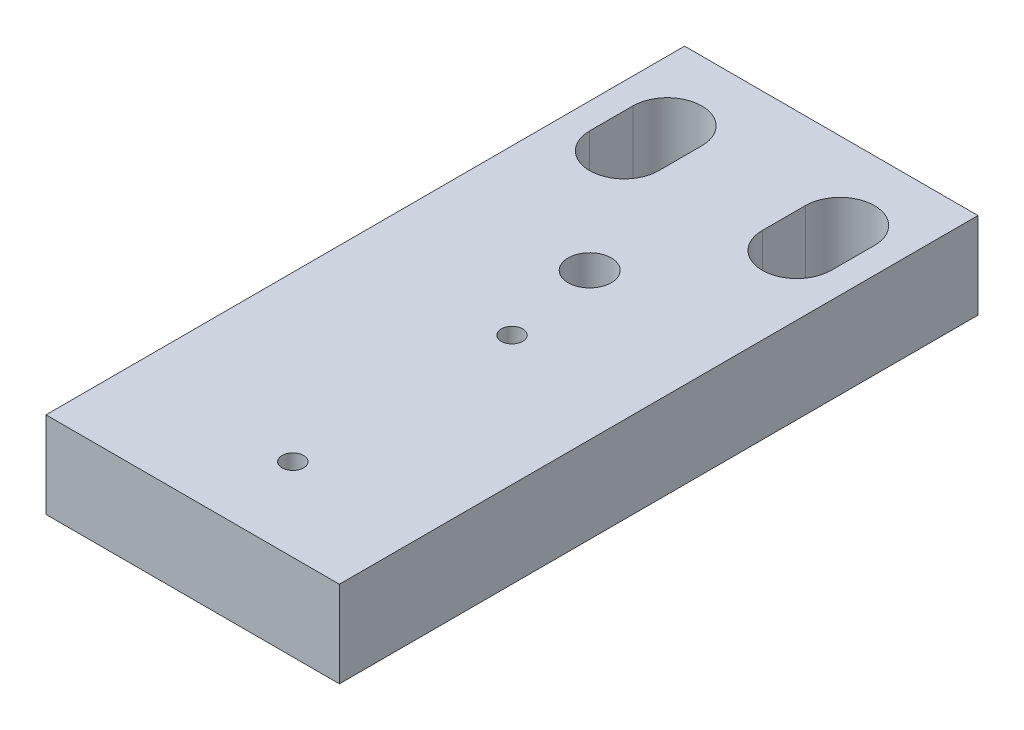
ISO-10303-21;
HEADER;
FILE_DESCRIPTION(('STEP AP214'),'2;1');
FILE_NAME('part.step','',(''),(''),'','','');
FILE_SCHEMA(('AUTOMOTIVE_DESIGN { 1 0 10303 214 1 1 1 1 }'));
ENDSEC;
DATA;
#1=APPLICATION_CONTEXT('core data for automotive mechanical design processes');
#2=APPLICATION_PROTOCOL_DEFINITION('international standard','automotive_design',2000,#1);
#3=PRODUCT_CONTEXT('',#1,'mechanical');
#4=PRODUCT('Part','Part','',(#3));
#5=PRODUCT_RELATED_PRODUCT_CATEGORY('part','',(#4));
#6=PRODUCT_DEFINITION_FORMATION('','',#4);
#7=PRODUCT_DEFINITION_CONTEXT('part definition',#1,'design');
#8=PRODUCT_DEFINITION('design','',#6,#7);
#9=PRODUCT_DEFINITION_SHAPE('','',#8);
#10=(LENGTH_UNIT() NAMED_UNIT(*) SI_UNIT(.MILLI.,.METRE.));
#11=(NAMED_UNIT(*) PLANE_ANGLE_UNIT() SI_UNIT($,.RADIAN.));
#12=(NAMED_UNIT(*) SI_UNIT($,.STERADIAN.) SOLID_ANGLE_UNIT());
#13=UNCERTAINTY_MEASURE_WITH_UNIT(LENGTH_MEASURE(1.E-05),#10,'distance_accuracy_value','');
#14=(GEOMETRIC_REPRESENTATION_CONTEXT(3) GLOBAL_UNCERTAINTY_ASSIGNED_CONTEXT((#13)) GLOBAL_UNIT_ASSIGNED_CONTEXT((#10,
#11,#12)) REPRESENTATION_CONTEXT('',''));
#15=CARTESIAN_POINT('',(0.,0.,0.));
#16=DIRECTION('',(0.,0.,1.));
#17=DIRECTION('',(1.,0.,0.));
#18=AXIS2_PLACEMENT_3D('',#15,#16,#17);
#19=CARTESIAN_POINT('',(0.,10.,0.));
#20=DIRECTION('',(0.,1.,0.));
#21=DIRECTION('',(0.,0.,1.));
#22=AXIS2_PLACEMENT_3D('',#19,#20,#21);
#23=PLANE('',#22);
#24=CARTESIAN_POINT('',(0.,10.,-9.));
#25=DIRECTION('',(0.,-1.,0.));
#26=DIRECTION('',(0.,0.,-1.));
#27=AXIS2_PLACEMENT_3D('',#24,#25,#26);
#28=CIRCLE('',#27,2.5);
#29=CARTESIAN_POINT('',(0.,10.,-11.5));
#30=VERTEX_POINT('',#29);
#31=EDGE_CURVE('P0_E170',#30,#30,#28,.T.);
#32=ORIENTED_EDGE('',*,*,#31,.T.);
#33=EDGE_LOOP('',(#32));
#34=FACE_BOUND('',#33,.T.);
#35=CARTESIAN_POINT('',(2.,10.,2.));
#36=DIRECTION('',(0.,1.,0.));
#37=DIRECTION('',(0.,0.,1.));
#38=AXIS2_PLACEMENT_3D('',#35,#36,#37);
#39=CIRCLE('',#38,1.25);
#40=CARTESIAN_POINT('',(2.,10.,3.25));
#41=VERTEX_POINT('',#40);
#42=EDGE_CURVE('P0_E173',#41,#41,#39,.F.);
#43=ORIENTED_EDGE('',*,*,#42,.T.);
#44=EDGE_LOOP('',(#43));
#45=FACE_BOUND('',#44,.T.);
#46=CARTESIAN_POINT('',(2.,10.,27.4));
#47=DIRECTION('',(0.,1.,0.));
#48=DIRECTION('',(0.,0.,1.));
#49=AXIS2_PLACEMENT_3D('',#46,#47,#48);
#50=CIRCLE('',#49,1.25);
#51=CARTESIAN_POINT('',(2.,10.,28.65));
#52=VERTEX_POINT('',#51);
#53=EDGE_CURVE('P0_E176',#52,#52,#50,.F.);
#54=ORIENTED_EDGE('',*,*,#53,.T.);
#55=EDGE_LOOP('',(#54));
#56=FACE_BOUND('',#55,.T.);
#57=CARTESIAN_POINT('',(10.,10.,-23.));
#58=DIRECTION('',(0.,1.,0.));
#59=DIRECTION('',(0.,0.,1.));
#60=AXIS2_PLACEMENT_3D('',#57,#58,#59);
#61=CIRCLE('',#60,4.);
#62=CARTESIAN_POINT('',(14.,10.,-23.));
#63=VERTEX_POINT('',#62);
#64=CARTESIAN_POINT('',(6.,10.,-23.));
#65=VERTEX_POINT('',#64);
#66=EDGE_CURVE('P0_E180',#63,#65,#61,.F.);
#67=ORIENTED_EDGE('',*,*,#66,.T.);
#68=DIRECTION('',(0.,0.,-1.));
#69=VECTOR('',#68,1.);
#70=CARTESIAN_POINT('',(6.,10.,-23.));
#71=LINE('',#70,#69);
#72=CARTESIAN_POINT('',(6.,10.,-28.));
#73=VERTEX_POINT('',#72);
#74=EDGE_CURVE('P0_E136',#73,#65,#71,.F.);
#75=ORIENTED_EDGE('',*,*,#74,.F.);
#76=CARTESIAN_POINT('',(10.,10.,-28.));
#77=DIRECTION('',(0.,1.,0.));
#78=DIRECTION('',(0.,0.,1.));
#79=AXIS2_PLACEMENT_3D('',#76,#77,#78);
#80=CIRCLE('',#79,4.);
#81=CARTESIAN_POINT('',(14.,10.,-28.));
#82=VERTEX_POINT('',#81);
#83=EDGE_CURVE('P0_E143',#73,#82,#80,.F.);
#84=ORIENTED_EDGE('',*,*,#83,.T.);
#85=DIRECTION('',(0.,0.,1.));
#86=VECTOR('',#85,1.);
#87=CARTESIAN_POINT('',(14.,10.,-28.));
#88=LINE('',#87,#86);
#89=EDGE_CURVE('P0_E140',#63,#82,#88,.F.);
#90=ORIENTED_EDGE('',*,*,#89,.F.);
#91=EDGE_LOOP('',(#67,#75,#84,#90));
#92=FACE_BOUND('',#91,.T.);
#93=CARTESIAN_POINT('',(-10.,10.,-28.));
#94=DIRECTION('',(0.,1.,0.));
#95=DIRECTION('',(0.,0.,1.));
#96=AXIS2_PLACEMENT_3D('',#93,#94,#95);
#97=CIRCLE('',#96,4.);
#98=CARTESIAN_POINT('',(-14.,10.,-28.));
#99=VERTEX_POINT('',#98);
#100=CARTESIAN_POINT('',(-6.,10.,-28.));
#101=VERTEX_POINT('',#100);
#102=EDGE_CURVE('P0_E184',#99,#101,#97,.F.);
#103=ORIENTED_EDGE('',*,*,#102,.T.);
#104=DIRECTION('',(0.,0.,1.));
#105=VECTOR('',#104,1.);
#106=CARTESIAN_POINT('',(-6.,10.,-28.));
#107=LINE('',#106,#105);
#108=CARTESIAN_POINT('',(-6.,10.,-23.));
#109=VERTEX_POINT('',#108);
#110=EDGE_CURVE('P0_E86',#109,#101,#107,.F.);
#111=ORIENTED_EDGE('',*,*,#110,.F.);
#112=CARTESIAN_POINT('',(-10.,10.,-23.));
#113=DIRECTION('',(0.,1.,0.));
#114=DIRECTION('',(0.,0.,1.));
#115=AXIS2_PLACEMENT_3D('',#112,#113,#114);
#116=CIRCLE('',#115,4.);
#117=CARTESIAN_POINT('',(-14.,10.,-23.));
#118=VERTEX_POINT('',#117);
#119=EDGE_CURVE('P0_E20',#109,#118,#116,.F.);
#120=ORIENTED_EDGE('',*,*,#119,.T.);
#121=DIRECTION('',(0.,0.,-1.));
#122=VECTOR('',#121,1.);
#123=CARTESIAN_POINT('',(-14.,10.,-23.));
#124=LINE('',#123,#122);
#125=EDGE_CURVE('P0_E147',#99,#118,#124,.F.);
#126=ORIENTED_EDGE('',*,*,#125,.F.);
#127=EDGE_LOOP('',(#103,#111,#120,#126));
#128=FACE_BOUND('',#127,.T.);
#129=DIRECTION('',(-1.,0.,0.));
#130=VECTOR('',#129,1.);
#131=CARTESIAN_POINT('',(17.,10.,-37.));
#132=LINE('',#131,#130);
#133=CARTESIAN_POINT('',(-17.,10.,-37.));
#134=VERTEX_POINT('',#133);
#135=CARTESIAN_POINT('',(17.,10.,-37.));
#136=VERTEX_POINT('',#135);
#137=EDGE_CURVE('P0_E96',#134,#136,#132,.F.);
#138=ORIENTED_EDGE('',*,*,#137,.F.);
#139=DIRECTION('',(0.,0.,1.));
#140=VECTOR('',#139,1.);
#141=CARTESIAN_POINT('',(-17.,10.,-37.));
#142=LINE('',#141,#140);
#143=CARTESIAN_POINT('',(-17.,10.,37.));
#144=VERTEX_POINT('',#143);
#145=EDGE_CURVE('P0_E123',#144,#134,#142,.F.);
#146=ORIENTED_EDGE('',*,*,#145,.F.);
#147=DIRECTION('',(1.,0.,0.));
#148=VECTOR('',#147,1.);
#149=CARTESIAN_POINT('',(-17.,10.,37.));
#150=LINE('',#149,#148);
#151=CARTESIAN_POINT('',(17.,10.,37.));
#152=VERTEX_POINT('',#151);
#153=EDGE_CURVE('P0_E114',#152,#144,#150,.F.);
#154=ORIENTED_EDGE('',*,*,#153,.F.);
#155=DIRECTION('',(0.,0.,-1.));
#156=VECTOR('',#155,1.);
#157=CARTESIAN_POINT('',(17.,10.,37.));
#158=LINE('',#157,#156);
#159=EDGE_CURVE('P0_E108',#136,#152,#158,.F.);
#160=ORIENTED_EDGE('',*,*,#159,.F.);
#161=EDGE_LOOP('',(#138,#146,#154,#160));
#162=FACE_BOUND('',#161,.T.);
#163=ADVANCED_FACE('P0_F17',(#34,#45,#56,#92,#128,#162),#23,.T.);
#164=CARTESIAN_POINT('',(-17.,0.,-37.));
#165=DIRECTION('',(-1.,0.,0.));
#166=DIRECTION('',(0.,0.,1.));
#167=AXIS2_PLACEMENT_3D('',#164,#165,#166);
#168=PLANE('',#167);
#169=DIRECTION('',(0.,1.,0.));
#170=VECTOR('',#169,1.);
#171=CARTESIAN_POINT('',(-17.,0.,-37.));
#172=LINE('',#171,#170);
#173=CARTESIAN_POINT('',(-17.,0.,-37.));
#174=VERTEX_POINT('',#173);
#175=EDGE_CURVE('P0_E200',#174,#134,#172,.T.);
#176=ORIENTED_EDGE('',*,*,#175,.F.);
#177=DIRECTION('',(0.,0.,1.));
#178=VECTOR('',#177,1.);
#179=CARTESIAN_POINT('',(-17.,0.,0.));
#180=LINE('',#179,#178);
#181=CARTESIAN_POINT('',(-17.,0.,37.));
#182=VERTEX_POINT('',#181);
#183=EDGE_CURVE('P0_E131',#174,#182,#180,.T.);
#184=ORIENTED_EDGE('',*,*,#183,.T.);
#185=DIRECTION('',(0.,1.,0.));
#186=VECTOR('',#185,1.);
#187=CARTESIAN_POINT('',(-17.,0.,37.));
#188=LINE('',#187,#186);
#189=EDGE_CURVE('P0_E119',#144,#182,#188,.F.);
#190=ORIENTED_EDGE('',*,*,#189,.F.);
#191=ORIENTED_EDGE('',*,*,#145,.T.);
#192=EDGE_LOOP('',(#176,#184,#190,#191));
#193=FACE_BOUND('',#192,.T.);
#194=ADVANCED_FACE('P0_F129',(#193),#168,.T.);
#195=CARTESIAN_POINT('',(-17.,0.,37.));
#196=DIRECTION('',(0.,0.,1.));
#197=DIRECTION('',(1.,0.,0.));
#198=AXIS2_PLACEMENT_3D('',#195,#196,#197);
#199=PLANE('',#198);
#200=ORIENTED_EDGE('',*,*,#189,.T.);
#201=DIRECTION('',(1.,0.,0.));
#202=VECTOR('',#201,1.);
#203=CARTESIAN_POINT('',(0.,0.,37.));
#204=LINE('',#203,#202);
#205=CARTESIAN_POINT('',(17.,0.,37.));
#206=VERTEX_POINT('',#205);
#207=EDGE_CURVE('P0_E210',#182,#206,#204,.T.);
#208=ORIENTED_EDGE('',*,*,#207,.T.);
#209=DIRECTION('',(0.,1.,0.));
#210=VECTOR('',#209,1.);
#211=CARTESIAN_POINT('',(17.,0.,37.));
#212=LINE('',#211,#210);
#213=EDGE_CURVE('P0_E121',#152,#206,#212,.F.);
#214=ORIENTED_EDGE('',*,*,#213,.F.);
#215=ORIENTED_EDGE('',*,*,#153,.T.);
#216=EDGE_LOOP('',(#200,#208,#214,#215));
#217=FACE_BOUND('',#216,.T.);
#218=ADVANCED_FACE('P0_F116',(#217),#199,.T.);
#219=CARTESIAN_POINT('',(17.,0.,37.));
#220=DIRECTION('',(1.,0.,0.));
#221=DIRECTION('',(0.,0.,-1.));
#222=AXIS2_PLACEMENT_3D('',#219,#220,#221);
#223=PLANE('',#222);
#224=ORIENTED_EDGE('',*,*,#213,.T.);
#225=DIRECTION('',(0.,0.,1.));
#226=VECTOR('',#225,1.);
#227=CARTESIAN_POINT('',(17.,0.,0.));
#228=LINE('',#227,#226);
#229=CARTESIAN_POINT('',(17.,0.,-37.));
#230=VERTEX_POINT('',#229);
#231=EDGE_CURVE('P0_E205',#206,#230,#228,.F.);
#232=ORIENTED_EDGE('',*,*,#231,.T.);
#233=DIRECTION('',(0.,1.,0.));
#234=VECTOR('',#233,1.);
#235=CARTESIAN_POINT('',(17.,0.,-37.));
#236=LINE('',#235,#234);
#237=EDGE_CURVE('P0_E146',#136,#230,#236,.F.);
#238=ORIENTED_EDGE('',*,*,#237,.F.);
#239=ORIENTED_EDGE('',*,*,#159,.T.);
#240=EDGE_LOOP('',(#224,#232,#238,#239));
#241=FACE_BOUND('',#240,.T.);
#242=ADVANCED_FACE('P0_F204',(#241),#223,.T.);
#243=CARTESIAN_POINT('',(17.,0.,-37.));
#244=DIRECTION('',(0.,0.,-1.));
#245=DIRECTION('',(-1.,0.,0.));
#246=AXIS2_PLACEMENT_3D('',#243,#244,#245);
#247=PLANE('',#246);
#248=ORIENTED_EDGE('',*,*,#237,.T.);
#249=DIRECTION('',(1.,0.,0.));
#250=VECTOR('',#249,1.);
#251=CARTESIAN_POINT('',(0.,0.,-37.));
#252=LINE('',#251,#250);
#253=EDGE_CURVE('P0_E212',#230,#174,#252,.F.);
#254=ORIENTED_EDGE('',*,*,#253,.T.);
#255=ORIENTED_EDGE('',*,*,#175,.T.);
#256=ORIENTED_EDGE('',*,*,#137,.T.);
#257=EDGE_LOOP('',(#248,#254,#255,#256));
#258=FACE_BOUND('',#257,.T.);
#259=ADVANCED_FACE('P0_F241',(#258),#247,.T.);
#260=CARTESIAN_POINT('',(-6.,0.,-28.));
#261=DIRECTION('',(-1.,0.,0.));
#262=DIRECTION('',(0.,0.,1.));
#263=AXIS2_PLACEMENT_3D('',#260,#261,#262);
#264=PLANE('',#263);
#265=DIRECTION('',(0.,1.,0.));
#266=VECTOR('',#265,1.);
#267=CARTESIAN_POINT('',(-6.,0.,-28.));
#268=LINE('',#267,#266);
#269=CARTESIAN_POINT('',(-6.,0.,-28.));
#270=VERTEX_POINT('',#269);
#271=EDGE_CURVE('P0_E139',#101,#270,#268,.F.);
#272=ORIENTED_EDGE('',*,*,#271,.T.);
#273=DIRECTION('',(0.,0.,1.));
#274=VECTOR('',#273,1.);
#275=CARTESIAN_POINT('',(-6.,0.,0.));
#276=LINE('',#275,#274);
#277=CARTESIAN_POINT('',(-6.,0.,-23.));
#278=VERTEX_POINT('',#277);
#279=EDGE_CURVE('P0_E169',#270,#278,#276,.T.);
#280=ORIENTED_EDGE('',*,*,#279,.T.);
#281=DIRECTION('',(0.,1.,0.));
#282=VECTOR('',#281,1.);
#283=CARTESIAN_POINT('',(-6.,0.,-23.));
#284=LINE('',#283,#282);
#285=EDGE_CURVE('P0_E145',#278,#109,#284,.T.);
#286=ORIENTED_EDGE('',*,*,#285,.T.);
#287=ORIENTED_EDGE('',*,*,#110,.T.);
#288=EDGE_LOOP('',(#272,#280,#286,#287));
#289=FACE_BOUND('',#288,.T.);
#290=ADVANCED_FACE('P0_F244',(#289),#264,.T.);
#291=CARTESIAN_POINT('',(-10.,0.,-23.));
#292=DIRECTION('',(0.,1.,0.));
#293=DIRECTION('',(0.,0.,1.));
#294=AXIS2_PLACEMENT_3D('',#291,#292,#293);
#295=CYLINDRICAL_SURFACE('',#294,4.);
#296=ORIENTED_EDGE('',*,*,#119,.F.);
#297=ORIENTED_EDGE('',*,*,#285,.F.);
#298=CARTESIAN_POINT('',(-10.,0.,-23.));
#299=DIRECTION('',(0.,1.,0.));
#300=DIRECTION('',(0.,0.,1.));
#301=AXIS2_PLACEMENT_3D('',#298,#299,#300);
#302=CIRCLE('',#301,4.);
#303=CARTESIAN_POINT('',(-14.,0.,-23.));
#304=VERTEX_POINT('',#303);
#305=EDGE_CURVE('P0_E166',#278,#304,#302,.F.);
#306=ORIENTED_EDGE('',*,*,#305,.T.);
#307=DIRECTION('',(0.,1.,0.));
#308=VECTOR('',#307,1.);
#309=CARTESIAN_POINT('',(-14.,0.,-23.));
#310=LINE('',#309,#308);
#311=EDGE_CURVE('P0_E148',#118,#304,#310,.F.);
#312=ORIENTED_EDGE('',*,*,#311,.F.);
#313=EDGE_LOOP('',(#296,#297,#306,#312));
#314=FACE_BOUND('',#313,.T.);
#315=ADVANCED_FACE('P0_F251',(#314),#295,.F.);
#316=CARTESIAN_POINT('',(-14.,0.,-23.));
#317=DIRECTION('',(1.,0.,0.));
#318=DIRECTION('',(0.,0.,-1.));
#319=AXIS2_PLACEMENT_3D('',#316,#317,#318);
#320=PLANE('',#319);
#321=ORIENTED_EDGE('',*,*,#311,.T.);
#322=DIRECTION('',(0.,0.,1.));
#323=VECTOR('',#322,1.);
#324=CARTESIAN_POINT('',(-14.,0.,0.));
#325=LINE('',#324,#323);
#326=CARTESIAN_POINT('',(-14.,0.,-28.));
#327=VERTEX_POINT('',#326);
#328=EDGE_CURVE('P0_E165',#304,#327,#325,.F.);
#329=ORIENTED_EDGE('',*,*,#328,.T.);
#330=DIRECTION('',(0.,1.,0.));
#331=VECTOR('',#330,1.);
#332=CARTESIAN_POINT('',(-14.,0.,-28.));
#333=LINE('',#332,#331);
#334=EDGE_CURVE('P0_E185',#327,#99,#333,.T.);
#335=ORIENTED_EDGE('',*,*,#334,.T.);
#336=ORIENTED_EDGE('',*,*,#125,.T.);
#337=EDGE_LOOP('',(#321,#329,#335,#336));
#338=FACE_BOUND('',#337,.T.);
#339=ADVANCED_FACE('P0_F288',(#338),#320,.T.);
#340=CARTESIAN_POINT('',(-10.,0.,-28.));
#341=DIRECTION('',(0.,1.,0.));
#342=DIRECTION('',(0.,0.,1.));
#343=AXIS2_PLACEMENT_3D('',#340,#341,#342);
#344=CYLINDRICAL_SURFACE('',#343,4.);
#345=ORIENTED_EDGE('',*,*,#102,.F.);
#346=ORIENTED_EDGE('',*,*,#334,.F.);
#347=CARTESIAN_POINT('',(-10.,0.,-28.));
#348=DIRECTION('',(0.,1.,0.));
#349=DIRECTION('',(0.,0.,1.));
#350=AXIS2_PLACEMENT_3D('',#347,#348,#349);
#351=CIRCLE('',#350,4.);
#352=EDGE_CURVE('P0_E162',#327,#270,#351,.F.);
#353=ORIENTED_EDGE('',*,*,#352,.T.);
#354=ORIENTED_EDGE('',*,*,#271,.F.);
#355=EDGE_LOOP('',(#345,#346,#353,#354));
#356=FACE_BOUND('',#355,.T.);
#357=ADVANCED_FACE('P0_F285',(#356),#344,.F.);
#358=CARTESIAN_POINT('',(6.,0.,-23.));
#359=DIRECTION('',(1.,0.,0.));
#360=DIRECTION('',(0.,0.,-1.));
#361=AXIS2_PLACEMENT_3D('',#358,#359,#360);
#362=PLANE('',#361);
#363=DIRECTION('',(0.,1.,0.));
#364=VECTOR('',#363,1.);
#365=CARTESIAN_POINT('',(6.,0.,-23.));
#366=LINE('',#365,#364);
#367=CARTESIAN_POINT('',(6.,0.,-23.));
#368=VERTEX_POINT('',#367);
#369=EDGE_CURVE('P0_E179',#65,#368,#366,.F.);
#370=ORIENTED_EDGE('',*,*,#369,.T.);
#371=DIRECTION('',(0.,0.,1.));
#372=VECTOR('',#371,1.);
#373=CARTESIAN_POINT('',(6.,0.,0.));
#374=LINE('',#373,#372);
#375=CARTESIAN_POINT('',(6.,0.,-28.));
#376=VERTEX_POINT('',#375);
#377=EDGE_CURVE('P0_E161',#368,#376,#374,.F.);
#378=ORIENTED_EDGE('',*,*,#377,.T.);
#379=DIRECTION('',(0.,1.,0.));
#380=VECTOR('',#379,1.);
#381=CARTESIAN_POINT('',(6.,0.,-28.));
#382=LINE('',#381,#380);
#383=EDGE_CURVE('P0_E138',#376,#73,#382,.T.);
#384=ORIENTED_EDGE('',*,*,#383,.T.);
#385=ORIENTED_EDGE('',*,*,#74,.T.);
#386=EDGE_LOOP('',(#370,#378,#384,#385));
#387=FACE_BOUND('',#386,.T.);
#388=ADVANCED_FACE('P0_F224',(#387),#362,.T.);
#389=CARTESIAN_POINT('',(10.,0.,-28.));
#390=DIRECTION('',(0.,1.,0.));
#391=DIRECTION('',(0.,0.,1.));
#392=AXIS2_PLACEMENT_3D('',#389,#390,#391);
#393=CYLINDRICAL_SURFACE('',#392,4.);
#394=ORIENTED_EDGE('',*,*,#83,.F.);
#395=ORIENTED_EDGE('',*,*,#383,.F.);
#396=CARTESIAN_POINT('',(10.,0.,-28.));
#397=DIRECTION('',(0.,1.,0.));
#398=DIRECTION('',(0.,0.,1.));
#399=AXIS2_PLACEMENT_3D('',#396,#397,#398);
#400=CIRCLE('',#399,4.);
#401=CARTESIAN_POINT('',(14.,0.,-28.));
#402=VERTEX_POINT('',#401);
#403=EDGE_CURVE('P0_E158',#376,#402,#400,.F.);
#404=ORIENTED_EDGE('',*,*,#403,.T.);
#405=DIRECTION('',(0.,1.,0.));
#406=VECTOR('',#405,1.);
#407=CARTESIAN_POINT('',(14.,0.,-28.));
#408=LINE('',#407,#406);
#409=EDGE_CURVE('P0_E142',#82,#402,#408,.F.);
#410=ORIENTED_EDGE('',*,*,#409,.F.);
#411=EDGE_LOOP('',(#394,#395,#404,#410));
#412=FACE_BOUND('',#411,.T.);
#413=ADVANCED_FACE('P0_F229',(#412),#393,.F.);
#414=CARTESIAN_POINT('',(14.,0.,-28.));
#415=DIRECTION('',(-1.,0.,0.));
#416=DIRECTION('',(0.,0.,1.));
#417=AXIS2_PLACEMENT_3D('',#414,#415,#416);
#418=PLANE('',#417);
#419=ORIENTED_EDGE('',*,*,#409,.T.);
#420=DIRECTION('',(0.,0.,1.));
#421=VECTOR('',#420,1.);
#422=CARTESIAN_POINT('',(14.,0.,0.));
#423=LINE('',#422,#421);
#424=CARTESIAN_POINT('',(14.,0.,-23.));
#425=VERTEX_POINT('',#424);
#426=EDGE_CURVE('P0_E157',#402,#425,#423,.T.);
#427=ORIENTED_EDGE('',*,*,#426,.T.);
#428=DIRECTION('',(0.,1.,0.));
#429=VECTOR('',#428,1.);
#430=CARTESIAN_POINT('',(14.,0.,-23.));
#431=LINE('',#430,#429);
#432=EDGE_CURVE('P0_E35',#425,#63,#431,.T.);
#433=ORIENTED_EDGE('',*,*,#432,.T.);
#434=ORIENTED_EDGE('',*,*,#89,.T.);
#435=EDGE_LOOP('',(#419,#427,#433,#434));
#436=FACE_BOUND('',#435,.T.);
#437=ADVANCED_FACE('P0_F278',(#436),#418,.T.);
#438=CARTESIAN_POINT('',(10.,0.,-23.));
#439=DIRECTION('',(0.,1.,0.));
#440=DIRECTION('',(0.,0.,1.));
#441=AXIS2_PLACEMENT_3D('',#438,#439,#440);
#442=CYLINDRICAL_SURFACE('',#441,4.);
#443=ORIENTED_EDGE('',*,*,#66,.F.);
#444=ORIENTED_EDGE('',*,*,#432,.F.);
#445=CARTESIAN_POINT('',(10.,0.,-23.));
#446=DIRECTION('',(0.,1.,0.));
#447=DIRECTION('',(0.,0.,1.));
#448=AXIS2_PLACEMENT_3D('',#445,#446,#447);
#449=CIRCLE('',#448,4.);
#450=EDGE_CURVE('P0_E155',#425,#368,#449,.F.);
#451=ORIENTED_EDGE('',*,*,#450,.T.);
#452=ORIENTED_EDGE('',*,*,#369,.F.);
#453=EDGE_LOOP('',(#443,#444,#451,#452));
#454=FACE_BOUND('',#453,.T.);
#455=ADVANCED_FACE('P0_F274',(#454),#442,.F.);
#456=CARTESIAN_POINT('',(2.,-1.55,27.4));
#457=DIRECTION('',(0.,1.,0.));
#458=DIRECTION('',(0.,0.,1.));
#459=AXIS2_PLACEMENT_3D('',#456,#457,#458);
#460=CYLINDRICAL_SURFACE('',#459,1.25);
#461=ORIENTED_EDGE('',*,*,#53,.F.);
#462=EDGE_LOOP('',(#461));
#463=FACE_BOUND('',#462,.T.);
#464=CARTESIAN_POINT('',(2.,0.,27.4));
#465=DIRECTION('',(0.,1.,0.));
#466=DIRECTION('',(0.,0.,1.));
#467=AXIS2_PLACEMENT_3D('',#464,#465,#466);
#468=CIRCLE('',#467,1.25);
#469=CARTESIAN_POINT('',(2.,0.,28.65));
#470=VERTEX_POINT('',#469);
#471=EDGE_CURVE('P0_E152',#470,#470,#468,.F.);
#472=ORIENTED_EDGE('',*,*,#471,.T.);
#473=EDGE_LOOP('',(#472));
#474=FACE_BOUND('',#473,.T.);
#475=ADVANCED_FACE('P0_F270',(#463,#474),#460,.F.);
#476=CARTESIAN_POINT('',(2.,-1.55,2.));
#477=DIRECTION('',(0.,1.,0.));
#478=DIRECTION('',(0.,0.,1.));
#479=AXIS2_PLACEMENT_3D('',#476,#477,#478);
#480=CYLINDRICAL_SURFACE('',#479,1.25);
#481=ORIENTED_EDGE('',*,*,#42,.F.);
#482=EDGE_LOOP('',(#481));
#483=FACE_BOUND('',#482,.T.);
#484=CARTESIAN_POINT('',(2.,0.,2.));
#485=DIRECTION('',(0.,1.,0.));
#486=DIRECTION('',(0.,0.,1.));
#487=AXIS2_PLACEMENT_3D('',#484,#485,#486);
#488=CIRCLE('',#487,1.25);
#489=CARTESIAN_POINT('',(2.,0.,3.25));
#490=VERTEX_POINT('',#489);
#491=EDGE_CURVE('P0_E26',#490,#490,#488,.F.);
#492=ORIENTED_EDGE('',*,*,#491,.T.);
#493=EDGE_LOOP('',(#492));
#494=FACE_BOUND('',#493,.T.);
#495=ADVANCED_FACE('P0_F262',(#483,#494),#480,.F.);
#496=CARTESIAN_POINT('',(0.,10.,-9.));
#497=DIRECTION('',(0.,-1.,0.));
#498=DIRECTION('',(0.,0.,-1.));
#499=AXIS2_PLACEMENT_3D('',#496,#497,#498);
#500=CYLINDRICAL_SURFACE('',#499,2.5);
#501=ORIENTED_EDGE('',*,*,#31,.F.);
#502=EDGE_LOOP('',(#501));
#503=FACE_BOUND('',#502,.T.);
#504=CARTESIAN_POINT('',(0.,0.,-9.));
#505=DIRECTION('',(0.,-1.,0.));
#506=DIRECTION('',(0.,0.,-1.));
#507=AXIS2_PLACEMENT_3D('',#504,#505,#506);
#508=CIRCLE('',#507,2.5);
#509=CARTESIAN_POINT('',(0.,0.,-11.5));
#510=VERTEX_POINT('',#509);
#511=EDGE_CURVE('P0_E11',#510,#510,#508,.T.);
#512=ORIENTED_EDGE('',*,*,#511,.T.);
#513=EDGE_LOOP('',(#512));
#514=FACE_BOUND('',#513,.T.);
#515=ADVANCED_FACE('P0_F256',(#503,#514),#500,.F.);
#516=CARTESIAN_POINT('',(0.,0.,0.));
#517=DIRECTION('',(0.,1.,0.));
#518=DIRECTION('',(0.,0.,1.));
#519=AXIS2_PLACEMENT_3D('',#516,#517,#518);
#520=PLANE('',#519);
#521=ORIENTED_EDGE('',*,*,#511,.F.);
#522=EDGE_LOOP('',(#521));
#523=FACE_BOUND('',#522,.T.);
#524=ORIENTED_EDGE('',*,*,#491,.F.);
#525=EDGE_LOOP('',(#524));
#526=FACE_BOUND('',#525,.T.);
#527=ORIENTED_EDGE('',*,*,#471,.F.);
#528=EDGE_LOOP('',(#527));
#529=FACE_BOUND('',#528,.T.);
#530=ORIENTED_EDGE('',*,*,#426,.F.);
#531=ORIENTED_EDGE('',*,*,#403,.F.);
#532=ORIENTED_EDGE('',*,*,#377,.F.);
#533=ORIENTED_EDGE('',*,*,#450,.F.);
#534=EDGE_LOOP('',(#530,#531,#532,#533));
#535=FACE_BOUND('',#534,.T.);
#536=ORIENTED_EDGE('',*,*,#328,.F.);
#537=ORIENTED_EDGE('',*,*,#305,.F.);
#538=ORIENTED_EDGE('',*,*,#279,.F.);
#539=ORIENTED_EDGE('',*,*,#352,.F.);
#540=EDGE_LOOP('',(#536,#537,#538,#539));
#541=FACE_BOUND('',#540,.T.);
#542=ORIENTED_EDGE('',*,*,#231,.F.);
#543=ORIENTED_EDGE('',*,*,#207,.F.);
#544=ORIENTED_EDGE('',*,*,#183,.F.);
#545=ORIENTED_EDGE('',*,*,#253,.F.);
#546=EDGE_LOOP('',(#542,#543,#544,#545));
#547=FACE_BOUND('',#546,.T.);
#548=ADVANCED_FACE('P0_F209',(#523,#526,#529,#535,#541,#547),#520,.F.);
#549=CLOSED_SHELL('',(#163,#194,#218,#242,#259,#290,#315,#339,#357,#388,#413,#437,#455,#475,
#495,#515,#548));
#550=MANIFOLD_SOLID_BREP('P0_B1',#549);
#551=CARTESIAN_POINT('',(2.,-1.55,27.4));
#552=DIRECTION('',(0.,1.,0.));
#553=DIRECTION('',(0.,0.,1.));
#554=AXIS2_PLACEMENT_3D('',#551,#552,#553);
#555=CYLINDRICAL_SURFACE('',#554,1.5);
#556=CARTESIAN_POINT('',(2.,10.,27.4));
#557=DIRECTION('',(0.,1.,0.));
#558=DIRECTION('',(0.,0.,1.));
#559=AXIS2_PLACEMENT_3D('',#556,#557,#558);
#560=CIRCLE('',#559,1.5);
#561=CARTESIAN_POINT('',(2.,10.,28.9));
#562=VERTEX_POINT('',#561);
#563=EDGE_CURVE('P1_E10',#562,#562,#560,.F.);
#564=ORIENTED_EDGE('',*,*,#563,.T.);
#565=EDGE_LOOP('',(#564));
#566=FACE_BOUND('',#565,.T.);
#567=CARTESIAN_POINT('',(2.,0.,27.4));
#568=DIRECTION('',(0.,1.,0.));
#569=DIRECTION('',(0.,0.,1.));
#570=AXIS2_PLACEMENT_3D('',#567,#568,#569);
#571=CIRCLE('',#570,1.5);
#572=CARTESIAN_POINT('',(2.,0.,28.9));
#573=VERTEX_POINT('',#572);
#574=EDGE_CURVE('P1_E16',#573,#573,#571,.T.);
#575=ORIENTED_EDGE('',*,*,#574,.T.);
#576=EDGE_LOOP('',(#575));
#577=FACE_BOUND('',#576,.T.);
#578=ADVANCED_FACE('P1_F15',(#566,#577),#555,.T.);
#579=OPEN_SHELL('',(#578));
#580=SHELL_BASED_SURFACE_MODEL('P1_B1',(#579));
#581=CARTESIAN_POINT('',(2.,-1.55,2.));
#582=DIRECTION('',(0.,1.,0.));
#583=DIRECTION('',(0.,0.,1.));
#584=AXIS2_PLACEMENT_3D('',#581,#582,#583);
#585=CYLINDRICAL_SURFACE('',#584,1.5);
#586=CARTESIAN_POINT('',(2.,10.,2.));
#587=DIRECTION('',(0.,1.,0.));
#588=DIRECTION('',(0.,0.,1.));
#589=AXIS2_PLACEMENT_3D('',#586,#587,#588);
#590=CIRCLE('',#589,1.5);
#591=CARTESIAN_POINT('',(2.,10.,3.5));
#592=VERTEX_POINT('',#591);
#593=EDGE_CURVE('P2_E10',#592,#592,#590,.F.);
#594=ORIENTED_EDGE('',*,*,#593,.T.);
#595=EDGE_LOOP('',(#594));
#596=FACE_BOUND('',#595,.T.);
#597=CARTESIAN_POINT('',(2.,0.,2.));
#598=DIRECTION('',(0.,1.,0.));
#599=DIRECTION('',(0.,0.,1.));
#600=AXIS2_PLACEMENT_3D('',#597,#598,#599);
#601=CIRCLE('',#600,1.5);
#602=CARTESIAN_POINT('',(2.,0.,3.5));
#603=VERTEX_POINT('',#602);
#604=EDGE_CURVE('P2_E16',#603,#603,#601,.T.);
#605=ORIENTED_EDGE('',*,*,#604,.T.);
#606=EDGE_LOOP('',(#605));
#607=FACE_BOUND('',#606,.T.);
#608=ADVANCED_FACE('P2_F15',(#596,#607),#585,.T.);
#609=OPEN_SHELL('',(#608));
#610=SHELL_BASED_SURFACE_MODEL('P2_B1',(#609));
#611=ADVANCED_BREP_SHAPE_REPRESENTATION('',(#18,#550),#14);
#612=MANIFOLD_SURFACE_SHAPE_REPRESENTATION('',(#18,#580,#610),#14);
#613=SHAPE_REPRESENTATION('',(#18),#14);
#614=SHAPE_DEFINITION_REPRESENTATION(#9,#613);
#615=SHAPE_REPRESENTATION_RELATIONSHIP('','',#613,#611);
#616=SHAPE_REPRESENTATION_RELATIONSHIP('','',#613,#612);
ENDSEC;
END-ISO-10303-21;
